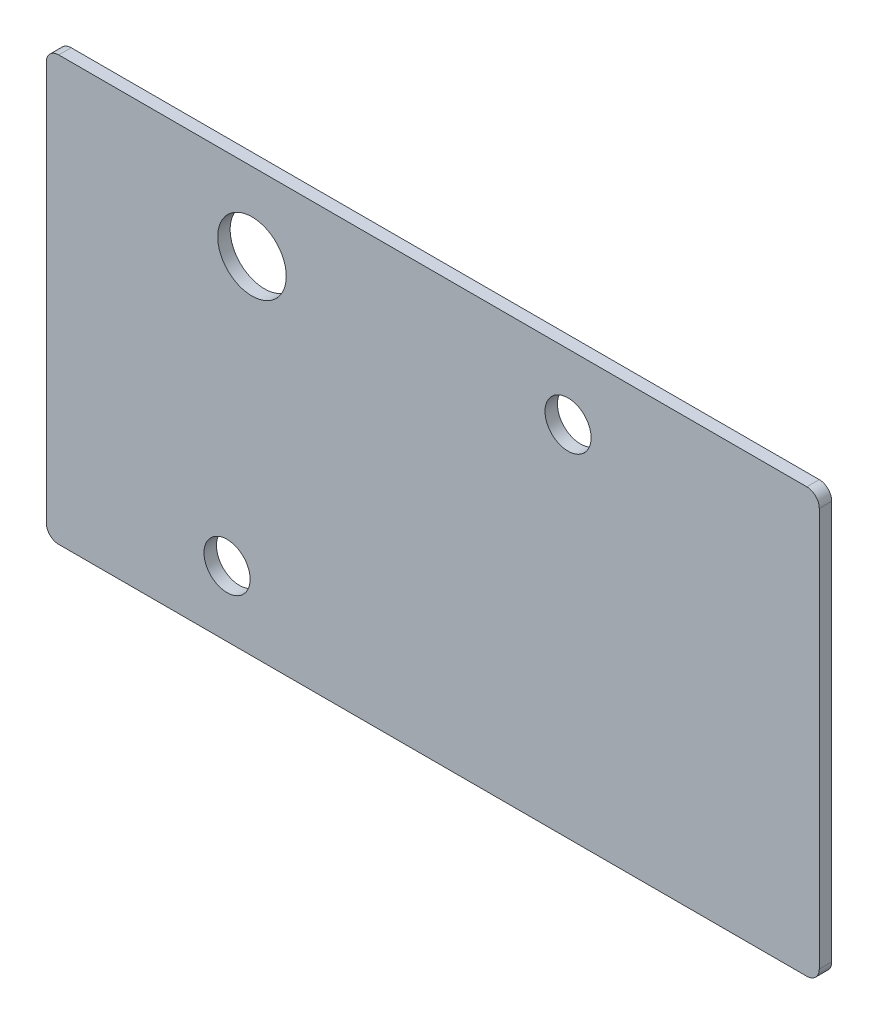
ISO-10303-21;
HEADER;
FILE_DESCRIPTION(('STEP AP214'),'2;1');
FILE_NAME('part.step','',(''),(''),'','','');
FILE_SCHEMA(('AUTOMOTIVE_DESIGN { 1 0 10303 214 1 1 1 1 }'));
ENDSEC;
DATA;
#1=APPLICATION_CONTEXT('core data for automotive mechanical design processes');
#2=APPLICATION_PROTOCOL_DEFINITION('international standard','automotive_design',2000,#1);
#3=PRODUCT_CONTEXT('',#1,'mechanical');
#4=PRODUCT('Part','Part','',(#3));
#5=PRODUCT_RELATED_PRODUCT_CATEGORY('part','',(#4));
#6=PRODUCT_DEFINITION_FORMATION('','',#4);
#7=PRODUCT_DEFINITION_CONTEXT('part definition',#1,'design');
#8=PRODUCT_DEFINITION('design','',#6,#7);
#9=PRODUCT_DEFINITION_SHAPE('','',#8);
#10=(LENGTH_UNIT() NAMED_UNIT(*) SI_UNIT(.MILLI.,.METRE.));
#11=(NAMED_UNIT(*) PLANE_ANGLE_UNIT() SI_UNIT($,.RADIAN.));
#12=(NAMED_UNIT(*) SI_UNIT($,.STERADIAN.) SOLID_ANGLE_UNIT());
#13=UNCERTAINTY_MEASURE_WITH_UNIT(LENGTH_MEASURE(1.E-05),#10,'distance_accuracy_value','');
#14=(GEOMETRIC_REPRESENTATION_CONTEXT(3) GLOBAL_UNCERTAINTY_ASSIGNED_CONTEXT((#13)) GLOBAL_UNIT_ASSIGNED_CONTEXT((#10,
#11,#12)) REPRESENTATION_CONTEXT('',''));
#15=CARTESIAN_POINT('',(0.,0.,0.));
#16=DIRECTION('',(0.,0.,1.));
#17=DIRECTION('',(1.,0.,0.));
#18=AXIS2_PLACEMENT_3D('',#15,#16,#17);
#19=CARTESIAN_POINT('',(-5.,-1.25,1.));
#20=DIRECTION('',(0.,0.,1.));
#21=DIRECTION('',(1.,0.,0.));
#22=AXIS2_PLACEMENT_3D('',#19,#20,#21);
#23=PLANE('',#22);
#24=CARTESIAN_POINT('',(10.5,25.5,1.));
#25=DIRECTION('',(0.,0.,1.));
#26=DIRECTION('',(1.,0.,0.));
#27=AXIS2_PLACEMENT_3D('',#24,#25,#26);
#28=CIRCLE('',#27,2.75);
#29=CARTESIAN_POINT('',(13.25,25.5,1.));
#30=VERTEX_POINT('',#29);
#31=EDGE_CURVE('E208',#30,#30,#28,.T.);
#32=ORIENTED_EDGE('',*,*,#31,.F.);
#33=EDGE_LOOP('',(#32));
#34=FACE_BOUND('',#33,.T.);
#35=CARTESIAN_POINT('',(35.85,26.5,1.));
#36=DIRECTION('',(0.,0.,1.));
#37=DIRECTION('',(1.,0.,0.));
#38=AXIS2_PLACEMENT_3D('',#35,#36,#37);
#39=CIRCLE('',#38,1.85);
#40=CARTESIAN_POINT('',(37.7,26.5,1.));
#41=VERTEX_POINT('',#40);
#42=EDGE_CURVE('E144',#41,#41,#39,.T.);
#43=ORIENTED_EDGE('',*,*,#42,.F.);
#44=EDGE_LOOP('',(#43));
#45=FACE_BOUND('',#44,.T.);
#46=CARTESIAN_POINT('',(-5.,-1.25,1.));
#47=DIRECTION('',(0.,0.,1.));
#48=DIRECTION('',(1.,0.,0.));
#49=AXIS2_PLACEMENT_3D('',#46,#47,#48);
#50=CIRCLE('',#49,1.);
#51=CARTESIAN_POINT('',(-6.,-1.25,1.));
#52=VERTEX_POINT('',#51);
#53=CARTESIAN_POINT('',(-5.,-2.25,1.));
#54=VERTEX_POINT('',#53);
#55=EDGE_CURVE('E157',#52,#54,#50,.T.);
#56=ORIENTED_EDGE('',*,*,#55,.T.);
#57=DIRECTION('',(1.,0.,0.));
#58=VECTOR('',#57,1.);
#59=CARTESIAN_POINT('',(-5.,-2.25,1.));
#60=LINE('',#59,#58);
#61=CARTESIAN_POINT('',(55.,-2.25,1.));
#62=VERTEX_POINT('',#61);
#63=EDGE_CURVE('E101',#54,#62,#60,.T.);
#64=ORIENTED_EDGE('',*,*,#63,.T.);
#65=CARTESIAN_POINT('',(55.,-1.25,1.));
#66=DIRECTION('',(0.,0.,1.));
#67=DIRECTION('',(1.,0.,0.));
#68=AXIS2_PLACEMENT_3D('',#65,#66,#67);
#69=CIRCLE('',#68,1.);
#70=CARTESIAN_POINT('',(56.,-1.25,1.));
#71=VERTEX_POINT('',#70);
#72=EDGE_CURVE('E173',#62,#71,#69,.T.);
#73=ORIENTED_EDGE('',*,*,#72,.T.);
#74=DIRECTION('',(0.,1.,0.));
#75=VECTOR('',#74,1.);
#76=CARTESIAN_POINT('',(56.,-1.25,1.));
#77=LINE('',#76,#75);
#78=CARTESIAN_POINT('',(56.,30.75,1.));
#79=VERTEX_POINT('',#78);
#80=EDGE_CURVE('E186',#71,#79,#77,.T.);
#81=ORIENTED_EDGE('',*,*,#80,.T.);
#82=CARTESIAN_POINT('',(55.,30.75,1.));
#83=DIRECTION('',(0.,0.,1.));
#84=DIRECTION('',(1.,0.,0.));
#85=AXIS2_PLACEMENT_3D('',#82,#83,#84);
#86=CIRCLE('',#85,1.);
#87=CARTESIAN_POINT('',(55.,31.75,1.));
#88=VERTEX_POINT('',#87);
#89=EDGE_CURVE('E120',#79,#88,#86,.T.);
#90=ORIENTED_EDGE('',*,*,#89,.T.);
#91=DIRECTION('',(-1.,0.,0.));
#92=VECTOR('',#91,1.);
#93=CARTESIAN_POINT('',(-5.,31.75,1.));
#94=LINE('',#93,#92);
#95=CARTESIAN_POINT('',(-5.,31.75,1.));
#96=VERTEX_POINT('',#95);
#97=EDGE_CURVE('E114',#88,#96,#94,.T.);
#98=ORIENTED_EDGE('',*,*,#97,.T.);
#99=CARTESIAN_POINT('',(-5.,30.75,1.));
#100=DIRECTION('',(0.,0.,1.));
#101=DIRECTION('',(1.,0.,0.));
#102=AXIS2_PLACEMENT_3D('',#99,#100,#101);
#103=CIRCLE('',#102,1.);
#104=CARTESIAN_POINT('',(-6.,30.75,1.));
#105=VERTEX_POINT('',#104);
#106=EDGE_CURVE('E118',#96,#105,#103,.T.);
#107=ORIENTED_EDGE('',*,*,#106,.T.);
#108=DIRECTION('',(0.,-1.,0.));
#109=VECTOR('',#108,1.);
#110=CARTESIAN_POINT('',(-6.,-1.25,1.));
#111=LINE('',#110,#109);
#112=EDGE_CURVE('E56',#105,#52,#111,.T.);
#113=ORIENTED_EDGE('',*,*,#112,.T.);
#114=EDGE_LOOP('',(#56,#64,#73,#81,#90,#98,#107,#113));
#115=FACE_BOUND('',#114,.T.);
#116=CARTESIAN_POINT('',(8.5,3.,1.));
#117=DIRECTION('',(0.,0.,1.));
#118=DIRECTION('',(1.,0.,0.));
#119=AXIS2_PLACEMENT_3D('',#116,#117,#118);
#120=CIRCLE('',#119,1.85);
#121=CARTESIAN_POINT('',(10.35,3.,1.));
#122=VERTEX_POINT('',#121);
#123=EDGE_CURVE('E197',#122,#122,#120,.T.);
#124=ORIENTED_EDGE('',*,*,#123,.F.);
#125=EDGE_LOOP('',(#124));
#126=FACE_BOUND('',#125,.T.);
#127=ADVANCED_FACE('F36',(#34,#45,#115,#126),#23,.T.);
#128=CARTESIAN_POINT('',(-5.,-1.25,0.));
#129=DIRECTION('',(0.,0.,1.));
#130=DIRECTION('',(1.,0.,0.));
#131=AXIS2_PLACEMENT_3D('',#128,#129,#130);
#132=PLANE('',#131);
#133=CARTESIAN_POINT('',(10.5,25.5,0.));
#134=DIRECTION('',(0.,0.,1.));
#135=DIRECTION('',(1.,0.,0.));
#136=AXIS2_PLACEMENT_3D('',#133,#134,#135);
#137=CIRCLE('',#136,2.75);
#138=CARTESIAN_POINT('',(13.25,25.5,0.));
#139=VERTEX_POINT('',#138);
#140=EDGE_CURVE('E204',#139,#139,#137,.T.);
#141=ORIENTED_EDGE('',*,*,#140,.T.);
#142=EDGE_LOOP('',(#141));
#143=FACE_BOUND('',#142,.T.);
#144=CARTESIAN_POINT('',(35.85,26.5,0.));
#145=DIRECTION('',(0.,0.,1.));
#146=DIRECTION('',(1.,0.,0.));
#147=AXIS2_PLACEMENT_3D('',#144,#145,#146);
#148=CIRCLE('',#147,1.85);
#149=CARTESIAN_POINT('',(37.7,26.5,0.));
#150=VERTEX_POINT('',#149);
#151=EDGE_CURVE('E194',#150,#150,#148,.T.);
#152=ORIENTED_EDGE('',*,*,#151,.T.);
#153=EDGE_LOOP('',(#152));
#154=FACE_BOUND('',#153,.T.);
#155=CARTESIAN_POINT('',(-5.,-1.25,0.));
#156=DIRECTION('',(0.,0.,1.));
#157=DIRECTION('',(1.,0.,0.));
#158=AXIS2_PLACEMENT_3D('',#155,#156,#157);
#159=CIRCLE('',#158,1.);
#160=CARTESIAN_POINT('',(-6.,-1.25,0.));
#161=VERTEX_POINT('',#160);
#162=CARTESIAN_POINT('',(-5.,-2.25,0.));
#163=VERTEX_POINT('',#162);
#164=EDGE_CURVE('E139',#161,#163,#159,.T.);
#165=ORIENTED_EDGE('',*,*,#164,.F.);
#166=DIRECTION('',(0.,-1.,0.));
#167=VECTOR('',#166,1.);
#168=CARTESIAN_POINT('',(-6.,-1.25,0.));
#169=LINE('',#168,#167);
#170=CARTESIAN_POINT('',(-6.,30.75,0.));
#171=VERTEX_POINT('',#170);
#172=EDGE_CURVE('E93',#171,#161,#169,.T.);
#173=ORIENTED_EDGE('',*,*,#172,.F.);
#174=CARTESIAN_POINT('',(-5.,30.75,0.));
#175=DIRECTION('',(0.,0.,1.));
#176=DIRECTION('',(1.,0.,0.));
#177=AXIS2_PLACEMENT_3D('',#174,#175,#176);
#178=CIRCLE('',#177,1.);
#179=CARTESIAN_POINT('',(-5.,31.75,0.));
#180=VERTEX_POINT('',#179);
#181=EDGE_CURVE('E86',#180,#171,#178,.T.);
#182=ORIENTED_EDGE('',*,*,#181,.F.);
#183=DIRECTION('',(-1.,0.,0.));
#184=VECTOR('',#183,1.);
#185=CARTESIAN_POINT('',(-5.,31.75,0.));
#186=LINE('',#185,#184);
#187=CARTESIAN_POINT('',(55.,31.75,0.));
#188=VERTEX_POINT('',#187);
#189=EDGE_CURVE('E128',#188,#180,#186,.T.);
#190=ORIENTED_EDGE('',*,*,#189,.F.);
#191=CARTESIAN_POINT('',(55.,30.75,0.));
#192=DIRECTION('',(0.,0.,1.));
#193=DIRECTION('',(1.,0.,0.));
#194=AXIS2_PLACEMENT_3D('',#191,#192,#193);
#195=CIRCLE('',#194,1.);
#196=CARTESIAN_POINT('',(56.,30.75,0.));
#197=VERTEX_POINT('',#196);
#198=EDGE_CURVE('E151',#197,#188,#195,.T.);
#199=ORIENTED_EDGE('',*,*,#198,.F.);
#200=DIRECTION('',(0.,1.,0.));
#201=VECTOR('',#200,1.);
#202=CARTESIAN_POINT('',(56.,-1.25,0.));
#203=LINE('',#202,#201);
#204=CARTESIAN_POINT('',(56.,-1.25,0.));
#205=VERTEX_POINT('',#204);
#206=EDGE_CURVE('E149',#205,#197,#203,.T.);
#207=ORIENTED_EDGE('',*,*,#206,.F.);
#208=CARTESIAN_POINT('',(55.,-1.25,0.));
#209=DIRECTION('',(0.,0.,1.));
#210=DIRECTION('',(1.,0.,0.));
#211=AXIS2_PLACEMENT_3D('',#208,#209,#210);
#212=CIRCLE('',#211,1.);
#213=CARTESIAN_POINT('',(55.,-2.25,0.));
#214=VERTEX_POINT('',#213);
#215=EDGE_CURVE('E147',#214,#205,#212,.T.);
#216=ORIENTED_EDGE('',*,*,#215,.F.);
#217=DIRECTION('',(1.,0.,0.));
#218=VECTOR('',#217,1.);
#219=CARTESIAN_POINT('',(-5.,-2.25,0.));
#220=LINE('',#219,#218);
#221=EDGE_CURVE('E143',#163,#214,#220,.T.);
#222=ORIENTED_EDGE('',*,*,#221,.F.);
#223=EDGE_LOOP('',(#165,#173,#182,#190,#199,#207,#216,#222));
#224=FACE_BOUND('',#223,.T.);
#225=CARTESIAN_POINT('',(8.5,3.,0.));
#226=DIRECTION('',(0.,0.,1.));
#227=DIRECTION('',(1.,0.,0.));
#228=AXIS2_PLACEMENT_3D('',#225,#226,#227);
#229=CIRCLE('',#228,1.85);
#230=CARTESIAN_POINT('',(10.35,3.,0.));
#231=VERTEX_POINT('',#230);
#232=EDGE_CURVE('E200',#231,#231,#229,.T.);
#233=ORIENTED_EDGE('',*,*,#232,.T.);
#234=EDGE_LOOP('',(#233));
#235=FACE_BOUND('',#234,.T.);
#236=ADVANCED_FACE('F177',(#143,#154,#224,#235),#132,.F.);
#237=CARTESIAN_POINT('',(-5.,-1.25,1.));
#238=DIRECTION('',(0.,0.,-1.));
#239=DIRECTION('',(-1.,0.,0.));
#240=AXIS2_PLACEMENT_3D('',#237,#238,#239);
#241=CYLINDRICAL_SURFACE('',#240,1.);
#242=ORIENTED_EDGE('',*,*,#164,.T.);
#243=DIRECTION('',(0.,0.,-1.));
#244=VECTOR('',#243,1.);
#245=CARTESIAN_POINT('',(-5.,-2.25,1.));
#246=LINE('',#245,#244);
#247=EDGE_CURVE('E11',#54,#163,#246,.T.);
#248=ORIENTED_EDGE('',*,*,#247,.F.);
#249=ORIENTED_EDGE('',*,*,#55,.F.);
#250=DIRECTION('',(0.,0.,-1.));
#251=VECTOR('',#250,1.);
#252=CARTESIAN_POINT('',(-6.,-1.25,1.));
#253=LINE('',#252,#251);
#254=EDGE_CURVE('E135',#52,#161,#253,.T.);
#255=ORIENTED_EDGE('',*,*,#254,.T.);
#256=EDGE_LOOP('',(#242,#248,#249,#255));
#257=FACE_BOUND('',#256,.T.);
#258=ADVANCED_FACE('F38',(#257),#241,.T.);
#259=CARTESIAN_POINT('',(-5.,-2.25,1.));
#260=DIRECTION('',(0.,1.,0.));
#261=DIRECTION('',(-1.,0.,0.));
#262=AXIS2_PLACEMENT_3D('',#259,#260,#261);
#263=PLANE('',#262);
#264=ORIENTED_EDGE('',*,*,#221,.T.);
#265=DIRECTION('',(0.,0.,-1.));
#266=VECTOR('',#265,1.);
#267=CARTESIAN_POINT('',(55.,-2.25,1.));
#268=LINE('',#267,#266);
#269=EDGE_CURVE('E46',#62,#214,#268,.T.);
#270=ORIENTED_EDGE('',*,*,#269,.F.);
#271=ORIENTED_EDGE('',*,*,#63,.F.);
#272=ORIENTED_EDGE('',*,*,#247,.T.);
#273=EDGE_LOOP('',(#264,#270,#271,#272));
#274=FACE_BOUND('',#273,.T.);
#275=ADVANCED_FACE('F239',(#274),#263,.F.);
#276=CARTESIAN_POINT('',(55.,-1.25,1.));
#277=DIRECTION('',(0.,0.,-1.));
#278=DIRECTION('',(-1.,0.,0.));
#279=AXIS2_PLACEMENT_3D('',#276,#277,#278);
#280=CYLINDRICAL_SURFACE('',#279,1.);
#281=ORIENTED_EDGE('',*,*,#215,.T.);
#282=DIRECTION('',(0.,0.,-1.));
#283=VECTOR('',#282,1.);
#284=CARTESIAN_POINT('',(56.,-1.25,1.));
#285=LINE('',#284,#283);
#286=EDGE_CURVE('E165',#71,#205,#285,.T.);
#287=ORIENTED_EDGE('',*,*,#286,.F.);
#288=ORIENTED_EDGE('',*,*,#72,.F.);
#289=ORIENTED_EDGE('',*,*,#269,.T.);
#290=EDGE_LOOP('',(#281,#287,#288,#289));
#291=FACE_BOUND('',#290,.T.);
#292=ADVANCED_FACE('F171',(#291),#280,.T.);
#293=CARTESIAN_POINT('',(56.,-1.25,1.));
#294=DIRECTION('',(-1.,0.,0.));
#295=DIRECTION('',(0.,0.,1.));
#296=AXIS2_PLACEMENT_3D('',#293,#294,#295);
#297=PLANE('',#296);
#298=ORIENTED_EDGE('',*,*,#206,.T.);
#299=DIRECTION('',(0.,0.,-1.));
#300=VECTOR('',#299,1.);
#301=CARTESIAN_POINT('',(56.,30.75,1.));
#302=LINE('',#301,#300);
#303=EDGE_CURVE('E162',#79,#197,#302,.T.);
#304=ORIENTED_EDGE('',*,*,#303,.F.);
#305=ORIENTED_EDGE('',*,*,#80,.F.);
#306=ORIENTED_EDGE('',*,*,#286,.T.);
#307=EDGE_LOOP('',(#298,#304,#305,#306));
#308=FACE_BOUND('',#307,.T.);
#309=ADVANCED_FACE('F182',(#308),#297,.F.);
#310=CARTESIAN_POINT('',(55.,30.75,1.));
#311=DIRECTION('',(0.,0.,-1.));
#312=DIRECTION('',(-1.,0.,0.));
#313=AXIS2_PLACEMENT_3D('',#310,#311,#312);
#314=CYLINDRICAL_SURFACE('',#313,1.);
#315=ORIENTED_EDGE('',*,*,#198,.T.);
#316=DIRECTION('',(0.,0.,-1.));
#317=VECTOR('',#316,1.);
#318=CARTESIAN_POINT('',(55.,31.75,1.));
#319=LINE('',#318,#317);
#320=EDGE_CURVE('E129',#88,#188,#319,.T.);
#321=ORIENTED_EDGE('',*,*,#320,.F.);
#322=ORIENTED_EDGE('',*,*,#89,.F.);
#323=ORIENTED_EDGE('',*,*,#303,.T.);
#324=EDGE_LOOP('',(#315,#321,#322,#323));
#325=FACE_BOUND('',#324,.T.);
#326=ADVANCED_FACE('F185',(#325),#314,.T.);
#327=CARTESIAN_POINT('',(-5.,31.75,1.));
#328=DIRECTION('',(0.,-1.,0.));
#329=DIRECTION('',(0.,0.,-1.));
#330=AXIS2_PLACEMENT_3D('',#327,#328,#329);
#331=PLANE('',#330);
#332=ORIENTED_EDGE('',*,*,#189,.T.);
#333=DIRECTION('',(0.,0.,-1.));
#334=VECTOR('',#333,1.);
#335=CARTESIAN_POINT('',(-5.,31.75,1.));
#336=LINE('',#335,#334);
#337=EDGE_CURVE('E125',#96,#180,#336,.T.);
#338=ORIENTED_EDGE('',*,*,#337,.F.);
#339=ORIENTED_EDGE('',*,*,#97,.F.);
#340=ORIENTED_EDGE('',*,*,#320,.T.);
#341=EDGE_LOOP('',(#332,#338,#339,#340));
#342=FACE_BOUND('',#341,.T.);
#343=ADVANCED_FACE('F126',(#342),#331,.F.);
#344=CARTESIAN_POINT('',(-5.,30.75,1.));
#345=DIRECTION('',(0.,0.,-1.));
#346=DIRECTION('',(-1.,0.,0.));
#347=AXIS2_PLACEMENT_3D('',#344,#345,#346);
#348=CYLINDRICAL_SURFACE('',#347,1.);
#349=ORIENTED_EDGE('',*,*,#181,.T.);
#350=DIRECTION('',(0.,0.,-1.));
#351=VECTOR('',#350,1.);
#352=CARTESIAN_POINT('',(-6.,30.75,1.));
#353=LINE('',#352,#351);
#354=EDGE_CURVE('E130',#105,#171,#353,.T.);
#355=ORIENTED_EDGE('',*,*,#354,.F.);
#356=ORIENTED_EDGE('',*,*,#106,.F.);
#357=ORIENTED_EDGE('',*,*,#337,.T.);
#358=EDGE_LOOP('',(#349,#355,#356,#357));
#359=FACE_BOUND('',#358,.T.);
#360=ADVANCED_FACE('F132',(#359),#348,.T.);
#361=CARTESIAN_POINT('',(-6.,-1.25,1.));
#362=DIRECTION('',(1.,0.,0.));
#363=DIRECTION('',(0.,0.,-1.));
#364=AXIS2_PLACEMENT_3D('',#361,#362,#363);
#365=PLANE('',#364);
#366=ORIENTED_EDGE('',*,*,#172,.T.);
#367=ORIENTED_EDGE('',*,*,#254,.F.);
#368=ORIENTED_EDGE('',*,*,#112,.F.);
#369=ORIENTED_EDGE('',*,*,#354,.T.);
#370=EDGE_LOOP('',(#366,#367,#368,#369));
#371=FACE_BOUND('',#370,.T.);
#372=ADVANCED_FACE('F231',(#371),#365,.F.);
#373=CARTESIAN_POINT('',(35.85,26.5,1.));
#374=DIRECTION('',(0.,0.,-1.));
#375=DIRECTION('',(-1.,0.,0.));
#376=AXIS2_PLACEMENT_3D('',#373,#374,#375);
#377=CYLINDRICAL_SURFACE('',#376,1.85);
#378=ORIENTED_EDGE('',*,*,#42,.T.);
#379=EDGE_LOOP('',(#378));
#380=FACE_BOUND('',#379,.T.);
#381=ORIENTED_EDGE('',*,*,#151,.F.);
#382=EDGE_LOOP('',(#381));
#383=FACE_BOUND('',#382,.T.);
#384=ADVANCED_FACE('F228',(#380,#383),#377,.F.);
#385=CARTESIAN_POINT('',(8.5,3.,1.));
#386=DIRECTION('',(0.,0.,-1.));
#387=DIRECTION('',(-1.,0.,0.));
#388=AXIS2_PLACEMENT_3D('',#385,#386,#387);
#389=CYLINDRICAL_SURFACE('',#388,1.85);
#390=ORIENTED_EDGE('',*,*,#123,.T.);
#391=EDGE_LOOP('',(#390));
#392=FACE_BOUND('',#391,.T.);
#393=ORIENTED_EDGE('',*,*,#232,.F.);
#394=EDGE_LOOP('',(#393));
#395=FACE_BOUND('',#394,.T.);
#396=ADVANCED_FACE('F219',(#392,#395),#389,.F.);
#397=CARTESIAN_POINT('',(10.5,25.5,0.));
#398=DIRECTION('',(0.,0.,1.));
#399=DIRECTION('',(1.,0.,0.));
#400=AXIS2_PLACEMENT_3D('',#397,#398,#399);
#401=CYLINDRICAL_SURFACE('',#400,2.75);
#402=ORIENTED_EDGE('',*,*,#140,.F.);
#403=EDGE_LOOP('',(#402));
#404=FACE_BOUND('',#403,.T.);
#405=ORIENTED_EDGE('',*,*,#31,.T.);
#406=EDGE_LOOP('',(#405));
#407=FACE_BOUND('',#406,.T.);
#408=ADVANCED_FACE('F216',(#404,#407),#401,.F.);
#409=CLOSED_SHELL('',(#127,#236,#258,#275,#292,#309,#326,#343,#360,#372,#384,#396,#408));
#410=MANIFOLD_SOLID_BREP('B2',#409);
#411=ADVANCED_BREP_SHAPE_REPRESENTATION('',(#18,#410),#14);
#412=SHAPE_DEFINITION_REPRESENTATION(#9,#411);
ENDSEC;
END-ISO-10303-21;
